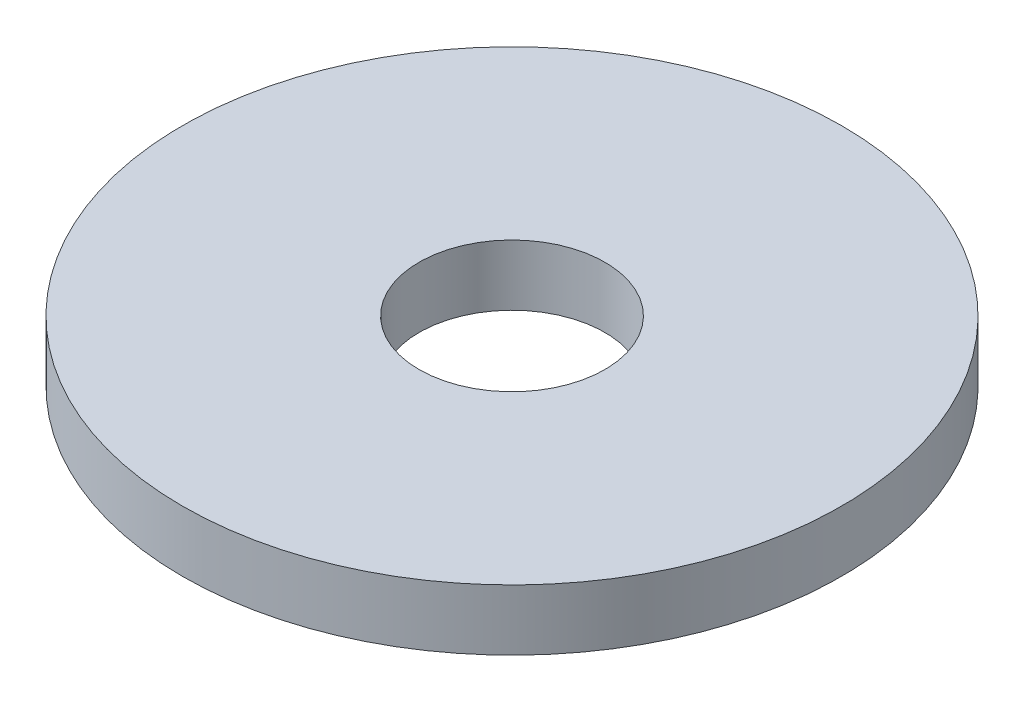
ISO-10303-21;
HEADER;
FILE_DESCRIPTION(('STEP AP214'),'2;1');
FILE_NAME('part.step','',(''),(''),'','','');
FILE_SCHEMA(('AUTOMOTIVE_DESIGN { 1 0 10303 214 1 1 1 1 }'));
ENDSEC;
DATA;
#1=APPLICATION_CONTEXT('core data for automotive mechanical design processes');
#2=APPLICATION_PROTOCOL_DEFINITION('international standard','automotive_design',2000,#1);
#3=PRODUCT_CONTEXT('',#1,'mechanical');
#4=PRODUCT('Part','Part','',(#3));
#5=PRODUCT_RELATED_PRODUCT_CATEGORY('part','',(#4));
#6=PRODUCT_DEFINITION_FORMATION('','',#4);
#7=PRODUCT_DEFINITION_CONTEXT('part definition',#1,'design');
#8=PRODUCT_DEFINITION('design','',#6,#7);
#9=PRODUCT_DEFINITION_SHAPE('','',#8);
#10=(LENGTH_UNIT() NAMED_UNIT(*) SI_UNIT(.MILLI.,.METRE.));
#11=(NAMED_UNIT(*) PLANE_ANGLE_UNIT() SI_UNIT($,.RADIAN.));
#12=(NAMED_UNIT(*) SI_UNIT($,.STERADIAN.) SOLID_ANGLE_UNIT());
#13=UNCERTAINTY_MEASURE_WITH_UNIT(LENGTH_MEASURE(1.E-05),#10,'distance_accuracy_value','');
#14=(GEOMETRIC_REPRESENTATION_CONTEXT(3) GLOBAL_UNCERTAINTY_ASSIGNED_CONTEXT((#13)) GLOBAL_UNIT_ASSIGNED_CONTEXT((#10,
#11,#12)) REPRESENTATION_CONTEXT('',''));
#15=CARTESIAN_POINT('',(0.,0.,0.));
#16=DIRECTION('',(0.,0.,1.));
#17=DIRECTION('',(1.,0.,0.));
#18=AXIS2_PLACEMENT_3D('',#15,#16,#17);
#19=CARTESIAN_POINT('',(0.,18.,0.));
#20=DIRECTION('',(0.,-1.,0.));
#21=DIRECTION('',(0.,0.,-1.));
#22=AXIS2_PLACEMENT_3D('',#19,#20,#21);
#23=CYLINDRICAL_SURFACE('',#22,97.5);
#24=CARTESIAN_POINT('',(0.,18.,0.));
#25=DIRECTION('',(0.,1.,0.));
#26=DIRECTION('',(0.,0.,1.));
#27=AXIS2_PLACEMENT_3D('',#24,#25,#26);
#28=CIRCLE('',#27,97.5);
#29=CARTESIAN_POINT('',(0.,18.,97.5));
#30=VERTEX_POINT('',#29);
#31=EDGE_CURVE('E10',#30,#30,#28,.T.);
#32=ORIENTED_EDGE('',*,*,#31,.F.);
#33=EDGE_LOOP('',(#32));
#34=FACE_BOUND('',#33,.T.);
#35=CARTESIAN_POINT('',(0.,0.,0.));
#36=DIRECTION('',(0.,1.,0.));
#37=DIRECTION('',(0.,0.,1.));
#38=AXIS2_PLACEMENT_3D('',#35,#36,#37);
#39=CIRCLE('',#38,97.5);
#40=CARTESIAN_POINT('',(0.,0.,97.5));
#41=VERTEX_POINT('',#40);
#42=EDGE_CURVE('E37',#41,#41,#39,.T.);
#43=ORIENTED_EDGE('',*,*,#42,.T.);
#44=EDGE_LOOP('',(#43));
#45=FACE_BOUND('',#44,.T.);
#46=ADVANCED_FACE('F40',(#34,#45),#23,.T.);
#47=CARTESIAN_POINT('',(0.,18.,0.));
#48=DIRECTION('',(0.,1.,0.));
#49=DIRECTION('',(0.,0.,1.));
#50=AXIS2_PLACEMENT_3D('',#47,#48,#49);
#51=PLANE('',#50);
#52=CARTESIAN_POINT('',(0.,18.,0.));
#53=DIRECTION('',(0.,1.,0.));
#54=DIRECTION('',(0.,0.,1.));
#55=AXIS2_PLACEMENT_3D('',#52,#53,#54);
#56=CIRCLE('',#55,27.5);
#57=CARTESIAN_POINT('',(0.,18.,27.5));
#58=VERTEX_POINT('',#57);
#59=EDGE_CURVE('E50',#58,#58,#56,.T.);
#60=ORIENTED_EDGE('',*,*,#59,.F.);
#61=EDGE_LOOP('',(#60));
#62=FACE_BOUND('',#61,.T.);
#63=ORIENTED_EDGE('',*,*,#31,.T.);
#64=EDGE_LOOP('',(#63));
#65=FACE_BOUND('',#64,.T.);
#66=ADVANCED_FACE('F59',(#62,#65),#51,.T.);
#67=CARTESIAN_POINT('',(0.,0.,0.));
#68=DIRECTION('',(0.,1.,0.));
#69=DIRECTION('',(0.,0.,1.));
#70=AXIS2_PLACEMENT_3D('',#67,#68,#69);
#71=PLANE('',#70);
#72=CARTESIAN_POINT('',(0.,0.,0.));
#73=DIRECTION('',(0.,1.,0.));
#74=DIRECTION('',(0.,0.,1.));
#75=AXIS2_PLACEMENT_3D('',#72,#73,#74);
#76=CIRCLE('',#75,27.5);
#77=CARTESIAN_POINT('',(0.,0.,27.5));
#78=VERTEX_POINT('',#77);
#79=EDGE_CURVE('E47',#78,#78,#76,.T.);
#80=ORIENTED_EDGE('',*,*,#79,.T.);
#81=EDGE_LOOP('',(#80));
#82=FACE_BOUND('',#81,.T.);
#83=ORIENTED_EDGE('',*,*,#42,.F.);
#84=EDGE_LOOP('',(#83));
#85=FACE_BOUND('',#84,.T.);
#86=ADVANCED_FACE('F58',(#82,#85),#71,.F.);
#87=CARTESIAN_POINT('',(0.,18.,0.));
#88=DIRECTION('',(0.,-1.,0.));
#89=DIRECTION('',(0.,0.,-1.));
#90=AXIS2_PLACEMENT_3D('',#87,#88,#89);
#91=CYLINDRICAL_SURFACE('',#90,27.5);
#92=ORIENTED_EDGE('',*,*,#59,.T.);
#93=EDGE_LOOP('',(#92));
#94=FACE_BOUND('',#93,.T.);
#95=ORIENTED_EDGE('',*,*,#79,.F.);
#96=EDGE_LOOP('',(#95));
#97=FACE_BOUND('',#96,.T.);
#98=ADVANCED_FACE('F54',(#94,#97),#91,.F.);
#99=CLOSED_SHELL('',(#46,#66,#86,#98));
#100=MANIFOLD_SOLID_BREP('B2',#99);
#101=ADVANCED_BREP_SHAPE_REPRESENTATION('',(#18,#100),#14);
#102=SHAPE_DEFINITION_REPRESENTATION(#9,#101);
ENDSEC;
END-ISO-10303-21;
